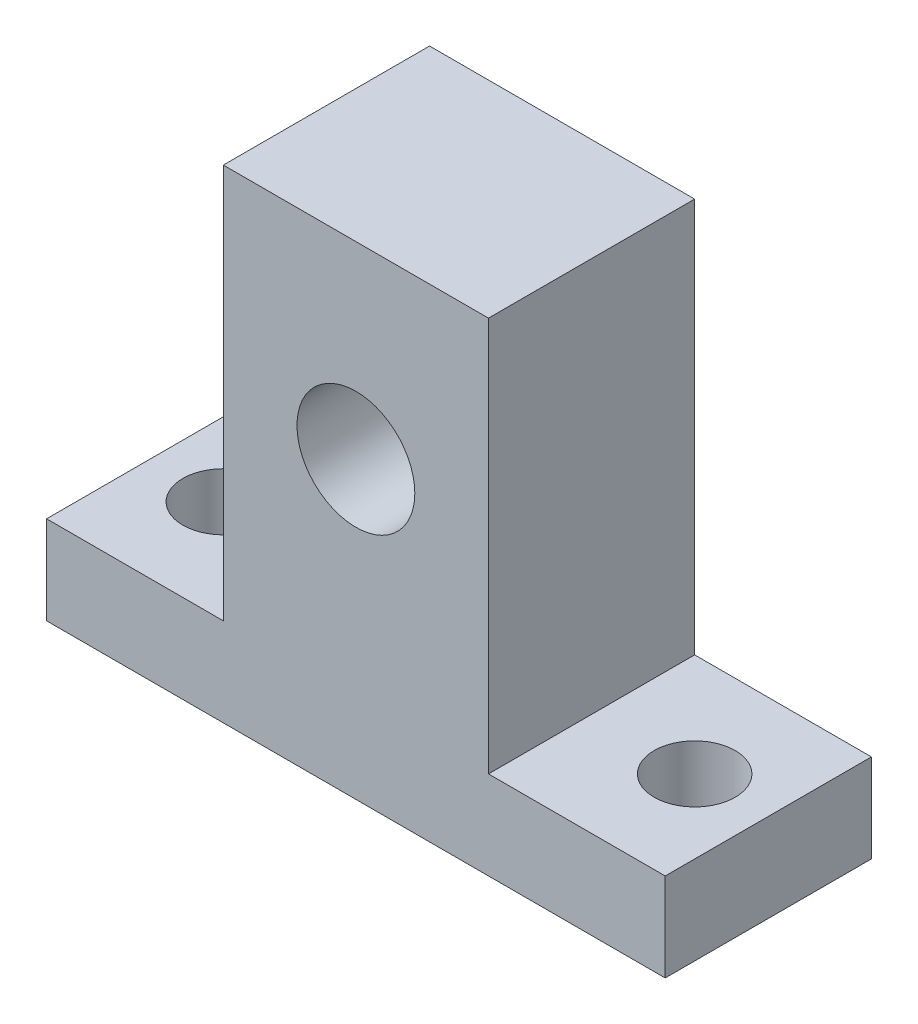
ISO-10303-21;
HEADER;
FILE_DESCRIPTION(('STEP AP214'),'2;1');
FILE_NAME('part.step','',(''),(''),'','','');
FILE_SCHEMA(('AUTOMOTIVE_DESIGN { 1 0 10303 214 1 1 1 1 }'));
ENDSEC;
DATA;
#1=APPLICATION_CONTEXT('core data for automotive mechanical design processes');
#2=APPLICATION_PROTOCOL_DEFINITION('international standard','automotive_design',2000,#1);
#3=PRODUCT_CONTEXT('',#1,'mechanical');
#4=PRODUCT('Part','Part','',(#3));
#5=PRODUCT_RELATED_PRODUCT_CATEGORY('part','',(#4));
#6=PRODUCT_DEFINITION_FORMATION('','',#4);
#7=PRODUCT_DEFINITION_CONTEXT('part definition',#1,'design');
#8=PRODUCT_DEFINITION('design','',#6,#7);
#9=PRODUCT_DEFINITION_SHAPE('','',#8);
#10=(LENGTH_UNIT() NAMED_UNIT(*) SI_UNIT(.MILLI.,.METRE.));
#11=(NAMED_UNIT(*) PLANE_ANGLE_UNIT() SI_UNIT($,.RADIAN.));
#12=(NAMED_UNIT(*) SI_UNIT($,.STERADIAN.) SOLID_ANGLE_UNIT());
#13=UNCERTAINTY_MEASURE_WITH_UNIT(LENGTH_MEASURE(1.E-05),#10,'distance_accuracy_value','');
#14=(GEOMETRIC_REPRESENTATION_CONTEXT(3) GLOBAL_UNCERTAINTY_ASSIGNED_CONTEXT((#13)) GLOBAL_UNIT_ASSIGNED_CONTEXT((#10,
#11,#12)) REPRESENTATION_CONTEXT('',''));
#15=CARTESIAN_POINT('',(0.,0.,0.));
#16=DIRECTION('',(0.,0.,1.));
#17=DIRECTION('',(1.,0.,0.));
#18=AXIS2_PLACEMENT_3D('',#15,#16,#17);
#19=CARTESIAN_POINT('',(0.,0.,14.));
#20=DIRECTION('',(0.,0.,-1.));
#21=DIRECTION('',(-1.,0.,0.));
#22=AXIS2_PLACEMENT_3D('',#19,#20,#21);
#23=PLANE('',#22);
#24=DIRECTION('',(0.,-1.,0.));
#25=VECTOR('',#24,1.);
#26=CARTESIAN_POINT('',(0.,0.,14.));
#27=LINE('',#26,#25);
#28=CARTESIAN_POINT('',(0.,6.,14.));
#29=VERTEX_POINT('',#28);
#30=CARTESIAN_POINT('',(0.,0.,14.));
#31=VERTEX_POINT('',#30);
#32=EDGE_CURVE('E145',#29,#31,#27,.T.);
#33=ORIENTED_EDGE('',*,*,#32,.T.);
#34=DIRECTION('',(1.,0.,0.));
#35=VECTOR('',#34,1.);
#36=CARTESIAN_POINT('',(0.,0.,14.));
#37=LINE('',#36,#35);
#38=CARTESIAN_POINT('',(42.,0.,14.));
#39=VERTEX_POINT('',#38);
#40=EDGE_CURVE('E93',#31,#39,#37,.T.);
#41=ORIENTED_EDGE('',*,*,#40,.T.);
#42=DIRECTION('',(0.,1.,0.));
#43=VECTOR('',#42,1.);
#44=CARTESIAN_POINT('',(42.,0.,14.));
#45=LINE('',#44,#43);
#46=CARTESIAN_POINT('',(42.,6.,14.));
#47=VERTEX_POINT('',#46);
#48=EDGE_CURVE('E160',#39,#47,#45,.T.);
#49=ORIENTED_EDGE('',*,*,#48,.T.);
#50=DIRECTION('',(-1.,0.,0.));
#51=VECTOR('',#50,1.);
#52=CARTESIAN_POINT('',(30.,6.,14.));
#53=LINE('',#52,#51);
#54=CARTESIAN_POINT('',(30.,6.,14.));
#55=VERTEX_POINT('',#54);
#56=EDGE_CURVE('E173',#47,#55,#53,.T.);
#57=ORIENTED_EDGE('',*,*,#56,.T.);
#58=DIRECTION('',(0.,1.,0.));
#59=VECTOR('',#58,1.);
#60=CARTESIAN_POINT('',(30.,6.,14.));
#61=LINE('',#60,#59);
#62=CARTESIAN_POINT('',(30.,32.8,14.));
#63=VERTEX_POINT('',#62);
#64=EDGE_CURVE('E112',#55,#63,#61,.T.);
#65=ORIENTED_EDGE('',*,*,#64,.T.);
#66=DIRECTION('',(-1.,0.,0.));
#67=VECTOR('',#66,1.);
#68=CARTESIAN_POINT('',(12.,32.8,14.));
#69=LINE('',#68,#67);
#70=CARTESIAN_POINT('',(12.,32.8,14.));
#71=VERTEX_POINT('',#70);
#72=EDGE_CURVE('E106',#63,#71,#69,.T.);
#73=ORIENTED_EDGE('',*,*,#72,.T.);
#74=DIRECTION('',(0.,-1.,0.));
#75=VECTOR('',#74,1.);
#76=CARTESIAN_POINT('',(12.,6.,14.));
#77=LINE('',#76,#75);
#78=CARTESIAN_POINT('',(12.,6.,14.));
#79=VERTEX_POINT('',#78);
#80=EDGE_CURVE('E110',#71,#79,#77,.T.);
#81=ORIENTED_EDGE('',*,*,#80,.T.);
#82=DIRECTION('',(-1.,0.,0.));
#83=VECTOR('',#82,1.);
#84=CARTESIAN_POINT('',(0.,6.,14.));
#85=LINE('',#84,#83);
#86=EDGE_CURVE('E50',#79,#29,#85,.T.);
#87=ORIENTED_EDGE('',*,*,#86,.T.);
#88=EDGE_LOOP('',(#33,#41,#49,#57,#65,#73,#81,#87));
#89=FACE_BOUND('',#88,.T.);
#90=CARTESIAN_POINT('',(21.,20.,14.));
#91=DIRECTION('',(0.,0.,1.));
#92=DIRECTION('',(1.,0.,0.));
#93=AXIS2_PLACEMENT_3D('',#90,#91,#92);
#94=CIRCLE('',#93,4.);
#95=CARTESIAN_POINT('',(25.,20.,14.));
#96=VERTEX_POINT('',#95);
#97=EDGE_CURVE('E134',#96,#96,#94,.T.);
#98=ORIENTED_EDGE('',*,*,#97,.F.);
#99=EDGE_LOOP('',(#98));
#100=FACE_BOUND('',#99,.T.);
#101=ADVANCED_FACE('F33',(#89,#100),#23,.F.);
#102=CARTESIAN_POINT('',(0.,0.,0.));
#103=DIRECTION('',(0.,0.,-1.));
#104=DIRECTION('',(-1.,0.,0.));
#105=AXIS2_PLACEMENT_3D('',#102,#103,#104);
#106=PLANE('',#105);
#107=DIRECTION('',(0.,-1.,0.));
#108=VECTOR('',#107,1.);
#109=CARTESIAN_POINT('',(0.,0.,0.));
#110=LINE('',#109,#108);
#111=CARTESIAN_POINT('',(0.,6.,0.));
#112=VERTEX_POINT('',#111);
#113=CARTESIAN_POINT('',(0.,0.,0.));
#114=VERTEX_POINT('',#113);
#115=EDGE_CURVE('E130',#112,#114,#110,.T.);
#116=ORIENTED_EDGE('',*,*,#115,.F.);
#117=DIRECTION('',(-1.,0.,0.));
#118=VECTOR('',#117,1.);
#119=CARTESIAN_POINT('',(0.,6.,0.));
#120=LINE('',#119,#118);
#121=CARTESIAN_POINT('',(12.,6.,0.));
#122=VERTEX_POINT('',#121);
#123=EDGE_CURVE('E85',#122,#112,#120,.T.);
#124=ORIENTED_EDGE('',*,*,#123,.F.);
#125=DIRECTION('',(0.,-1.,0.));
#126=VECTOR('',#125,1.);
#127=CARTESIAN_POINT('',(12.,6.,0.));
#128=LINE('',#127,#126);
#129=CARTESIAN_POINT('',(12.,32.8,0.));
#130=VERTEX_POINT('',#129);
#131=EDGE_CURVE('E79',#130,#122,#128,.T.);
#132=ORIENTED_EDGE('',*,*,#131,.F.);
#133=DIRECTION('',(-1.,0.,0.));
#134=VECTOR('',#133,1.);
#135=CARTESIAN_POINT('',(12.,32.8,0.));
#136=LINE('',#135,#134);
#137=CARTESIAN_POINT('',(30.,32.8,0.));
#138=VERTEX_POINT('',#137);
#139=EDGE_CURVE('E120',#138,#130,#136,.T.);
#140=ORIENTED_EDGE('',*,*,#139,.F.);
#141=DIRECTION('',(0.,1.,0.));
#142=VECTOR('',#141,1.);
#143=CARTESIAN_POINT('',(30.,6.,0.));
#144=LINE('',#143,#142);
#145=CARTESIAN_POINT('',(30.,6.,0.));
#146=VERTEX_POINT('',#145);
#147=EDGE_CURVE('E140',#146,#138,#144,.T.);
#148=ORIENTED_EDGE('',*,*,#147,.F.);
#149=DIRECTION('',(-1.,0.,0.));
#150=VECTOR('',#149,1.);
#151=CARTESIAN_POINT('',(30.,6.,0.));
#152=LINE('',#151,#150);
#153=CARTESIAN_POINT('',(42.,6.,0.));
#154=VERTEX_POINT('',#153);
#155=EDGE_CURVE('E138',#154,#146,#152,.T.);
#156=ORIENTED_EDGE('',*,*,#155,.F.);
#157=DIRECTION('',(0.,1.,0.));
#158=VECTOR('',#157,1.);
#159=CARTESIAN_POINT('',(42.,0.,0.));
#160=LINE('',#159,#158);
#161=CARTESIAN_POINT('',(42.,0.,0.));
#162=VERTEX_POINT('',#161);
#163=EDGE_CURVE('E136',#162,#154,#160,.T.);
#164=ORIENTED_EDGE('',*,*,#163,.F.);
#165=DIRECTION('',(1.,0.,0.));
#166=VECTOR('',#165,1.);
#167=CARTESIAN_POINT('',(0.,0.,0.));
#168=LINE('',#167,#166);
#169=EDGE_CURVE('E133',#114,#162,#168,.T.);
#170=ORIENTED_EDGE('',*,*,#169,.F.);
#171=EDGE_LOOP('',(#116,#124,#132,#140,#148,#156,#164,#170));
#172=FACE_BOUND('',#171,.T.);
#173=CARTESIAN_POINT('',(21.,20.,0.));
#174=DIRECTION('',(0.,0.,1.));
#175=DIRECTION('',(1.,0.,0.));
#176=AXIS2_PLACEMENT_3D('',#173,#174,#175);
#177=CIRCLE('',#176,4.);
#178=CARTESIAN_POINT('',(25.,20.,0.));
#179=VERTEX_POINT('',#178);
#180=EDGE_CURVE('E179',#179,#179,#177,.T.);
#181=ORIENTED_EDGE('',*,*,#180,.T.);
#182=EDGE_LOOP('',(#181));
#183=FACE_BOUND('',#182,.T.);
#184=ADVANCED_FACE('F164',(#172,#183),#106,.T.);
#185=CARTESIAN_POINT('',(0.,0.,14.));
#186=DIRECTION('',(1.,0.,0.));
#187=DIRECTION('',(0.,0.,-1.));
#188=AXIS2_PLACEMENT_3D('',#185,#186,#187);
#189=PLANE('',#188);
#190=ORIENTED_EDGE('',*,*,#115,.T.);
#191=DIRECTION('',(0.,0.,-1.));
#192=VECTOR('',#191,1.);
#193=CARTESIAN_POINT('',(0.,0.,14.));
#194=LINE('',#193,#192);
#195=EDGE_CURVE('E11',#31,#114,#194,.T.);
#196=ORIENTED_EDGE('',*,*,#195,.F.);
#197=ORIENTED_EDGE('',*,*,#32,.F.);
#198=DIRECTION('',(0.,0.,-1.));
#199=VECTOR('',#198,1.);
#200=CARTESIAN_POINT('',(0.,6.,14.));
#201=LINE('',#200,#199);
#202=EDGE_CURVE('E126',#29,#112,#201,.T.);
#203=ORIENTED_EDGE('',*,*,#202,.T.);
#204=EDGE_LOOP('',(#190,#196,#197,#203));
#205=FACE_BOUND('',#204,.T.);
#206=ADVANCED_FACE('F35',(#205),#189,.F.);
#207=CARTESIAN_POINT('',(0.,0.,14.));
#208=DIRECTION('',(0.,1.,0.));
#209=DIRECTION('',(0.,0.,1.));
#210=AXIS2_PLACEMENT_3D('',#207,#208,#209);
#211=PLANE('',#210);
#212=CARTESIAN_POINT('',(37.,0.,7.));
#213=DIRECTION('',(0.,1.,0.));
#214=DIRECTION('',(0.,0.,1.));
#215=AXIS2_PLACEMENT_3D('',#212,#213,#214);
#216=CIRCLE('',#215,2.75);
#217=CARTESIAN_POINT('',(37.,0.,9.75));
#218=VERTEX_POINT('',#217);
#219=EDGE_CURVE('E188',#218,#218,#216,.T.);
#220=ORIENTED_EDGE('',*,*,#219,.T.);
#221=EDGE_LOOP('',(#220));
#222=FACE_BOUND('',#221,.T.);
#223=CARTESIAN_POINT('',(5.,0.,7.));
#224=DIRECTION('',(0.,1.,0.));
#225=DIRECTION('',(0.,0.,1.));
#226=AXIS2_PLACEMENT_3D('',#223,#224,#225);
#227=CIRCLE('',#226,2.75);
#228=CARTESIAN_POINT('',(5.,0.,9.75));
#229=VERTEX_POINT('',#228);
#230=EDGE_CURVE('E182',#229,#229,#227,.T.);
#231=ORIENTED_EDGE('',*,*,#230,.T.);
#232=EDGE_LOOP('',(#231));
#233=FACE_BOUND('',#232,.T.);
#234=ORIENTED_EDGE('',*,*,#169,.T.);
#235=DIRECTION('',(0.,0.,-1.));
#236=VECTOR('',#235,1.);
#237=CARTESIAN_POINT('',(42.,0.,14.));
#238=LINE('',#237,#236);
#239=EDGE_CURVE('E42',#39,#162,#238,.T.);
#240=ORIENTED_EDGE('',*,*,#239,.F.);
#241=ORIENTED_EDGE('',*,*,#40,.F.);
#242=ORIENTED_EDGE('',*,*,#195,.T.);
#243=EDGE_LOOP('',(#234,#240,#241,#242));
#244=FACE_BOUND('',#243,.T.);
#245=ADVANCED_FACE('F197',(#222,#233,#244),#211,.F.);
#246=CARTESIAN_POINT('',(42.,0.,14.));
#247=DIRECTION('',(-1.,0.,0.));
#248=DIRECTION('',(0.,0.,1.));
#249=AXIS2_PLACEMENT_3D('',#246,#247,#248);
#250=PLANE('',#249);
#251=ORIENTED_EDGE('',*,*,#163,.T.);
#252=DIRECTION('',(0.,0.,-1.));
#253=VECTOR('',#252,1.);
#254=CARTESIAN_POINT('',(42.,6.,14.));
#255=LINE('',#254,#253);
#256=EDGE_CURVE('E152',#47,#154,#255,.T.);
#257=ORIENTED_EDGE('',*,*,#256,.F.);
#258=ORIENTED_EDGE('',*,*,#48,.F.);
#259=ORIENTED_EDGE('',*,*,#239,.T.);
#260=EDGE_LOOP('',(#251,#257,#258,#259));
#261=FACE_BOUND('',#260,.T.);
#262=ADVANCED_FACE('F158',(#261),#250,.F.);
#263=CARTESIAN_POINT('',(30.,6.,14.));
#264=DIRECTION('',(0.,-1.,0.));
#265=DIRECTION('',(0.,0.,-1.));
#266=AXIS2_PLACEMENT_3D('',#263,#264,#265);
#267=PLANE('',#266);
#268=CARTESIAN_POINT('',(37.,6.,7.));
#269=DIRECTION('',(0.,1.,0.));
#270=DIRECTION('',(0.,0.,1.));
#271=AXIS2_PLACEMENT_3D('',#268,#269,#270);
#272=CIRCLE('',#271,2.75);
#273=CARTESIAN_POINT('',(37.,6.,9.75));
#274=VERTEX_POINT('',#273);
#275=EDGE_CURVE('E191',#274,#274,#272,.T.);
#276=ORIENTED_EDGE('',*,*,#275,.F.);
#277=EDGE_LOOP('',(#276));
#278=FACE_BOUND('',#277,.T.);
#279=ORIENTED_EDGE('',*,*,#155,.T.);
#280=DIRECTION('',(0.,0.,-1.));
#281=VECTOR('',#280,1.);
#282=CARTESIAN_POINT('',(30.,6.,14.));
#283=LINE('',#282,#281);
#284=EDGE_CURVE('E149',#55,#146,#283,.T.);
#285=ORIENTED_EDGE('',*,*,#284,.F.);
#286=ORIENTED_EDGE('',*,*,#56,.F.);
#287=ORIENTED_EDGE('',*,*,#256,.T.);
#288=EDGE_LOOP('',(#279,#285,#286,#287));
#289=FACE_BOUND('',#288,.T.);
#290=ADVANCED_FACE('F169',(#278,#289),#267,.F.);
#291=CARTESIAN_POINT('',(30.,6.,14.));
#292=DIRECTION('',(-1.,0.,0.));
#293=DIRECTION('',(0.,0.,1.));
#294=AXIS2_PLACEMENT_3D('',#291,#292,#293);
#295=PLANE('',#294);
#296=ORIENTED_EDGE('',*,*,#147,.T.);
#297=DIRECTION('',(0.,0.,-1.));
#298=VECTOR('',#297,1.);
#299=CARTESIAN_POINT('',(30.,32.8,14.));
#300=LINE('',#299,#298);
#301=EDGE_CURVE('E121',#63,#138,#300,.T.);
#302=ORIENTED_EDGE('',*,*,#301,.F.);
#303=ORIENTED_EDGE('',*,*,#64,.F.);
#304=ORIENTED_EDGE('',*,*,#284,.T.);
#305=EDGE_LOOP('',(#296,#302,#303,#304));
#306=FACE_BOUND('',#305,.T.);
#307=ADVANCED_FACE('F172',(#306),#295,.F.);
#308=CARTESIAN_POINT('',(12.,32.8,14.));
#309=DIRECTION('',(0.,-1.,0.));
#310=DIRECTION('',(0.,0.,-1.));
#311=AXIS2_PLACEMENT_3D('',#308,#309,#310);
#312=PLANE('',#311);
#313=ORIENTED_EDGE('',*,*,#139,.T.);
#314=DIRECTION('',(0.,0.,-1.));
#315=VECTOR('',#314,1.);
#316=CARTESIAN_POINT('',(12.,32.8,14.));
#317=LINE('',#316,#315);
#318=EDGE_CURVE('E117',#71,#130,#317,.T.);
#319=ORIENTED_EDGE('',*,*,#318,.F.);
#320=ORIENTED_EDGE('',*,*,#72,.F.);
#321=ORIENTED_EDGE('',*,*,#301,.T.);
#322=EDGE_LOOP('',(#313,#319,#320,#321));
#323=FACE_BOUND('',#322,.T.);
#324=ADVANCED_FACE('F118',(#323),#312,.F.);
#325=CARTESIAN_POINT('',(12.,6.,14.));
#326=DIRECTION('',(1.,0.,0.));
#327=DIRECTION('',(0.,0.,-1.));
#328=AXIS2_PLACEMENT_3D('',#325,#326,#327);
#329=PLANE('',#328);
#330=ORIENTED_EDGE('',*,*,#131,.T.);
#331=DIRECTION('',(0.,0.,-1.));
#332=VECTOR('',#331,1.);
#333=CARTESIAN_POINT('',(12.,6.,14.));
#334=LINE('',#333,#332);
#335=EDGE_CURVE('E122',#79,#122,#334,.T.);
#336=ORIENTED_EDGE('',*,*,#335,.F.);
#337=ORIENTED_EDGE('',*,*,#80,.F.);
#338=ORIENTED_EDGE('',*,*,#318,.T.);
#339=EDGE_LOOP('',(#330,#336,#337,#338));
#340=FACE_BOUND('',#339,.T.);
#341=ADVANCED_FACE('F124',(#340),#329,.F.);
#342=CARTESIAN_POINT('',(0.,6.,14.));
#343=DIRECTION('',(0.,-1.,0.));
#344=DIRECTION('',(0.,0.,-1.));
#345=AXIS2_PLACEMENT_3D('',#342,#343,#344);
#346=PLANE('',#345);
#347=CARTESIAN_POINT('',(5.,6.,7.));
#348=DIRECTION('',(0.,1.,0.));
#349=DIRECTION('',(0.,0.,1.));
#350=AXIS2_PLACEMENT_3D('',#347,#348,#349);
#351=CIRCLE('',#350,2.75);
#352=CARTESIAN_POINT('',(5.,6.,9.75));
#353=VERTEX_POINT('',#352);
#354=EDGE_CURVE('E185',#353,#353,#351,.T.);
#355=ORIENTED_EDGE('',*,*,#354,.F.);
#356=EDGE_LOOP('',(#355));
#357=FACE_BOUND('',#356,.T.);
#358=ORIENTED_EDGE('',*,*,#123,.T.);
#359=ORIENTED_EDGE('',*,*,#202,.F.);
#360=ORIENTED_EDGE('',*,*,#86,.F.);
#361=ORIENTED_EDGE('',*,*,#335,.T.);
#362=EDGE_LOOP('',(#358,#359,#360,#361));
#363=FACE_BOUND('',#362,.T.);
#364=ADVANCED_FACE('F225',(#357,#363),#346,.F.);
#365=CARTESIAN_POINT('',(21.,20.,14.));
#366=DIRECTION('',(0.,0.,-1.));
#367=DIRECTION('',(-1.,0.,0.));
#368=AXIS2_PLACEMENT_3D('',#365,#366,#367);
#369=CYLINDRICAL_SURFACE('',#368,4.);
#370=ORIENTED_EDGE('',*,*,#97,.T.);
#371=EDGE_LOOP('',(#370));
#372=FACE_BOUND('',#371,.T.);
#373=ORIENTED_EDGE('',*,*,#180,.F.);
#374=EDGE_LOOP('',(#373));
#375=FACE_BOUND('',#374,.T.);
#376=ADVANCED_FACE('F222',(#372,#375),#369,.F.);
#377=CARTESIAN_POINT('',(5.,0.,7.));
#378=DIRECTION('',(0.,1.,0.));
#379=DIRECTION('',(0.,0.,1.));
#380=AXIS2_PLACEMENT_3D('',#377,#378,#379);
#381=CYLINDRICAL_SURFACE('',#380,2.75);
#382=ORIENTED_EDGE('',*,*,#230,.F.);
#383=EDGE_LOOP('',(#382));
#384=FACE_BOUND('',#383,.T.);
#385=ORIENTED_EDGE('',*,*,#354,.T.);
#386=EDGE_LOOP('',(#385));
#387=FACE_BOUND('',#386,.T.);
#388=ADVANCED_FACE('F203',(#384,#387),#381,.F.);
#389=CARTESIAN_POINT('',(37.,0.,7.));
#390=DIRECTION('',(0.,1.,0.));
#391=DIRECTION('',(0.,0.,1.));
#392=AXIS2_PLACEMENT_3D('',#389,#390,#391);
#393=CYLINDRICAL_SURFACE('',#392,2.75);
#394=ORIENTED_EDGE('',*,*,#219,.F.);
#395=EDGE_LOOP('',(#394));
#396=FACE_BOUND('',#395,.T.);
#397=ORIENTED_EDGE('',*,*,#275,.T.);
#398=EDGE_LOOP('',(#397));
#399=FACE_BOUND('',#398,.T.);
#400=ADVANCED_FACE('F200',(#396,#399),#393,.F.);
#401=CLOSED_SHELL('',(#101,#184,#206,#245,#262,#290,#307,#324,#341,#364,#376,#388,#400));
#402=MANIFOLD_SOLID_BREP('B2',#401);
#403=ADVANCED_BREP_SHAPE_REPRESENTATION('',(#18,#402),#14);
#404=SHAPE_DEFINITION_REPRESENTATION(#9,#403);
ENDSEC;
END-ISO-10303-21;
